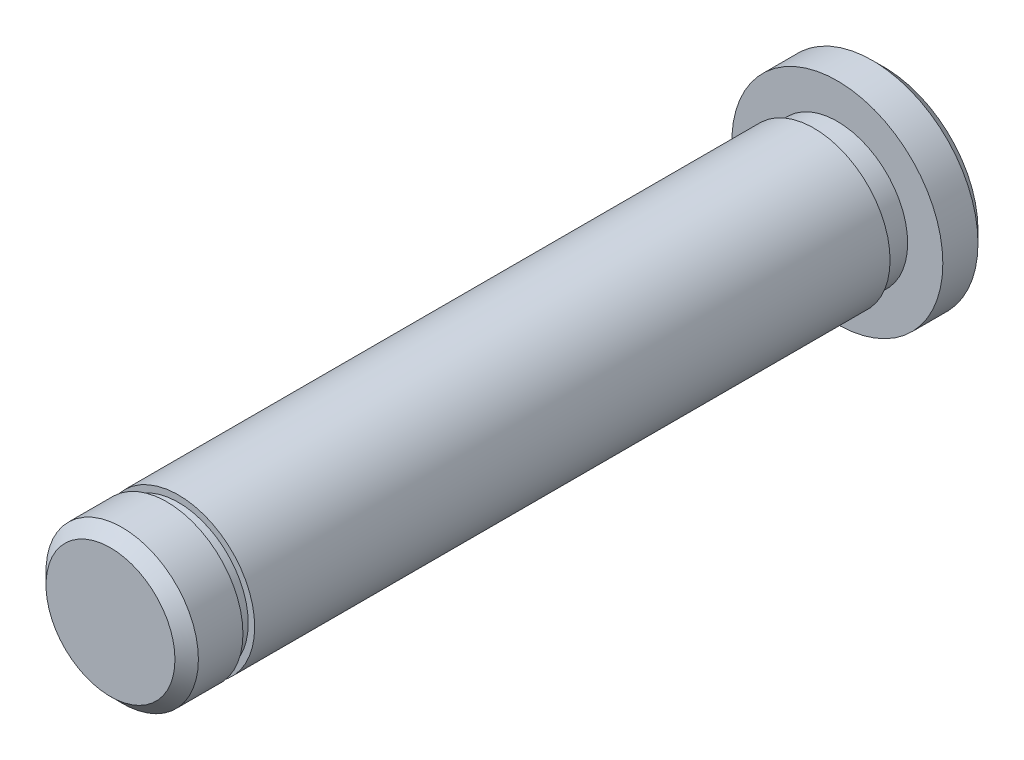
ISO-10303-21;
HEADER;
FILE_DESCRIPTION(('STEP AP214'),'2;1');
FILE_NAME('part.step','',(''),(''),'','','');
FILE_SCHEMA(('AUTOMOTIVE_DESIGN { 1 0 10303 214 1 1 1 1 }'));
ENDSEC;
DATA;
#1=APPLICATION_CONTEXT('core data for automotive mechanical design processes');
#2=APPLICATION_PROTOCOL_DEFINITION('international standard','automotive_design',2000,#1);
#3=PRODUCT_CONTEXT('',#1,'mechanical');
#4=PRODUCT('Part','Part','',(#3));
#5=PRODUCT_RELATED_PRODUCT_CATEGORY('part','',(#4));
#6=PRODUCT_DEFINITION_FORMATION('','',#4);
#7=PRODUCT_DEFINITION_CONTEXT('part definition',#1,'design');
#8=PRODUCT_DEFINITION('design','',#6,#7);
#9=PRODUCT_DEFINITION_SHAPE('','',#8);
#10=(LENGTH_UNIT() NAMED_UNIT(*) SI_UNIT(.MILLI.,.METRE.));
#11=(NAMED_UNIT(*) PLANE_ANGLE_UNIT() SI_UNIT($,.RADIAN.));
#12=(NAMED_UNIT(*) SI_UNIT($,.STERADIAN.) SOLID_ANGLE_UNIT());
#13=UNCERTAINTY_MEASURE_WITH_UNIT(LENGTH_MEASURE(1.E-05),#10,'distance_accuracy_value','');
#14=(GEOMETRIC_REPRESENTATION_CONTEXT(3) GLOBAL_UNCERTAINTY_ASSIGNED_CONTEXT((#13)) GLOBAL_UNIT_ASSIGNED_CONTEXT((#10,
#11,#12)) REPRESENTATION_CONTEXT('',''));
#15=CARTESIAN_POINT('',(0.,0.,0.));
#16=DIRECTION('',(0.,0.,1.));
#17=DIRECTION('',(1.,0.,0.));
#18=AXIS2_PLACEMENT_3D('',#15,#16,#17);
#19=CARTESIAN_POINT('',(0.,0.,66.));
#20=DIRECTION('',(0.,0.,-1.));
#21=DIRECTION('',(-1.,0.,0.));
#22=AXIS2_PLACEMENT_3D('',#19,#20,#21);
#23=CYLINDRICAL_SURFACE('',#22,6.5);
#24=CARTESIAN_POINT('',(0.,0.,6.));
#25=DIRECTION('',(0.,0.,1.));
#26=DIRECTION('',(1.,0.,0.));
#27=AXIS2_PLACEMENT_3D('',#24,#25,#26);
#28=CIRCLE('',#27,6.5);
#29=CARTESIAN_POINT('',(6.5,0.,6.));
#30=VERTEX_POINT('',#29);
#31=EDGE_CURVE('E67',#30,#30,#28,.T.);
#32=ORIENTED_EDGE('',*,*,#31,.T.);
#33=EDGE_LOOP('',(#32));
#34=FACE_BOUND('',#33,.T.);
#35=CARTESIAN_POINT('',(0.,0.,60.2));
#36=DIRECTION('',(0.,0.,1.));
#37=DIRECTION('',(1.,0.,0.));
#38=AXIS2_PLACEMENT_3D('',#35,#36,#37);
#39=CIRCLE('',#38,6.5);
#40=CARTESIAN_POINT('',(6.5,0.,60.2));
#41=VERTEX_POINT('',#40);
#42=EDGE_CURVE('E63',#41,#41,#39,.T.);
#43=ORIENTED_EDGE('',*,*,#42,.F.);
#44=EDGE_LOOP('',(#43));
#45=FACE_BOUND('',#44,.T.);
#46=ADVANCED_FACE('F37',(#34,#45),#23,.T.);
#47=CARTESIAN_POINT('',(0.,0.,4.));
#48=DIRECTION('',(0.,0.,-1.));
#49=DIRECTION('',(-1.,0.,0.));
#50=AXIS2_PLACEMENT_3D('',#47,#48,#49);
#51=CYLINDRICAL_SURFACE('',#50,9.);
#52=CARTESIAN_POINT('',(0.,0.,0.999999999999996));
#53=DIRECTION('',(0.,0.,1.));
#54=DIRECTION('',(1.,0.,0.));
#55=AXIS2_PLACEMENT_3D('',#52,#53,#54);
#56=CIRCLE('',#55,9.);
#57=CARTESIAN_POINT('',(9.,0.,0.999999999999996));
#58=VERTEX_POINT('',#57);
#59=EDGE_CURVE('E45',#58,#58,#56,.T.);
#60=ORIENTED_EDGE('',*,*,#59,.T.);
#61=EDGE_LOOP('',(#60));
#62=FACE_BOUND('',#61,.T.);
#63=CARTESIAN_POINT('',(0.,0.,4.));
#64=DIRECTION('',(0.,0.,1.));
#65=DIRECTION('',(1.,0.,0.));
#66=AXIS2_PLACEMENT_3D('',#63,#64,#65);
#67=CIRCLE('',#66,9.);
#68=CARTESIAN_POINT('',(9.,0.,4.));
#69=VERTEX_POINT('',#68);
#70=EDGE_CURVE('E58',#69,#69,#67,.T.);
#71=ORIENTED_EDGE('',*,*,#70,.F.);
#72=EDGE_LOOP('',(#71));
#73=FACE_BOUND('',#72,.T.);
#74=ADVANCED_FACE('F100',(#62,#73),#51,.T.);
#75=CARTESIAN_POINT('',(0.,0.,4.));
#76=DIRECTION('',(0.,0.,1.));
#77=DIRECTION('',(1.,0.,0.));
#78=AXIS2_PLACEMENT_3D('',#75,#76,#77);
#79=PLANE('',#78);
#80=ORIENTED_EDGE('',*,*,#70,.T.);
#81=EDGE_LOOP('',(#80));
#82=FACE_BOUND('',#81,.T.);
#83=CARTESIAN_POINT('',(0.,0.,4.));
#84=DIRECTION('',(0.,0.,1.));
#85=DIRECTION('',(1.,0.,0.));
#86=AXIS2_PLACEMENT_3D('',#83,#84,#85);
#87=CIRCLE('',#86,6.);
#88=CARTESIAN_POINT('',(6.,0.,4.));
#89=VERTEX_POINT('',#88);
#90=EDGE_CURVE('E62',#89,#89,#87,.T.);
#91=ORIENTED_EDGE('',*,*,#90,.F.);
#92=EDGE_LOOP('',(#91));
#93=FACE_BOUND('',#92,.T.);
#94=ADVANCED_FACE('F107',(#82,#93),#79,.T.);
#95=CARTESIAN_POINT('',(0.,0.,0.));
#96=DIRECTION('',(0.,0.,1.));
#97=DIRECTION('',(1.,0.,0.));
#98=AXIS2_PLACEMENT_3D('',#95,#96,#97);
#99=PLANE('',#98);
#100=CARTESIAN_POINT('',(0.,0.,0.));
#101=DIRECTION('',(0.,0.,1.));
#102=DIRECTION('',(1.,0.,0.));
#103=AXIS2_PLACEMENT_3D('',#100,#101,#102);
#104=CIRCLE('',#103,8.);
#105=CARTESIAN_POINT('',(8.,0.,0.));
#106=VERTEX_POINT('',#105);
#107=EDGE_CURVE('E11',#106,#106,#104,.F.);
#108=ORIENTED_EDGE('',*,*,#107,.T.);
#109=EDGE_LOOP('',(#108));
#110=FACE_BOUND('',#109,.T.);
#111=ADVANCED_FACE('F134',(#110),#99,.F.);
#112=CARTESIAN_POINT('',(0.,0.,6.));
#113=DIRECTION('',(0.,0.,1.));
#114=DIRECTION('',(1.,0.,0.));
#115=AXIS2_PLACEMENT_3D('',#112,#113,#114);
#116=PLANE('',#115);
#117=CARTESIAN_POINT('',(0.,0.,6.));
#118=DIRECTION('',(0.,0.,1.));
#119=DIRECTION('',(1.,0.,0.));
#120=AXIS2_PLACEMENT_3D('',#117,#118,#119);
#121=CIRCLE('',#120,6.);
#122=CARTESIAN_POINT('',(6.,0.,6.));
#123=VERTEX_POINT('',#122);
#124=EDGE_CURVE('E70',#123,#123,#121,.T.);
#125=ORIENTED_EDGE('',*,*,#124,.T.);
#126=EDGE_LOOP('',(#125));
#127=FACE_BOUND('',#126,.T.);
#128=ORIENTED_EDGE('',*,*,#31,.F.);
#129=EDGE_LOOP('',(#128));
#130=FACE_BOUND('',#129,.T.);
#131=ADVANCED_FACE('F129',(#127,#130),#116,.F.);
#132=CARTESIAN_POINT('',(0.,0.,6.));
#133=DIRECTION('',(0.,0.,-1.));
#134=DIRECTION('',(-1.,0.,0.));
#135=AXIS2_PLACEMENT_3D('',#132,#133,#134);
#136=CYLINDRICAL_SURFACE('',#135,6.);
#137=ORIENTED_EDGE('',*,*,#124,.F.);
#138=EDGE_LOOP('',(#137));
#139=FACE_BOUND('',#138,.T.);
#140=ORIENTED_EDGE('',*,*,#90,.T.);
#141=EDGE_LOOP('',(#140));
#142=FACE_BOUND('',#141,.T.);
#143=ADVANCED_FACE('F124',(#139,#142),#136,.T.);
#144=CARTESIAN_POINT('',(0.,0.,61.2));
#145=DIRECTION('',(0.,0.,1.));
#146=DIRECTION('',(1.,0.,0.));
#147=AXIS2_PLACEMENT_3D('',#144,#145,#146);
#148=PLANE('',#147);
#149=CARTESIAN_POINT('',(0.,0.,61.2));
#150=DIRECTION('',(0.,0.,1.));
#151=DIRECTION('',(1.,0.,0.));
#152=AXIS2_PLACEMENT_3D('',#149,#150,#151);
#153=CIRCLE('',#152,5.95);
#154=CARTESIAN_POINT('',(5.95,0.,61.2));
#155=VERTEX_POINT('',#154);
#156=EDGE_CURVE('E66',#155,#155,#153,.T.);
#157=ORIENTED_EDGE('',*,*,#156,.T.);
#158=EDGE_LOOP('',(#157));
#159=FACE_BOUND('',#158,.T.);
#160=CARTESIAN_POINT('',(0.,0.,61.2));
#161=DIRECTION('',(0.,0.,1.));
#162=DIRECTION('',(1.,0.,0.));
#163=AXIS2_PLACEMENT_3D('',#160,#161,#162);
#164=CIRCLE('',#163,6.5);
#165=CARTESIAN_POINT('',(6.5,0.,61.2));
#166=VERTEX_POINT('',#165);
#167=EDGE_CURVE('E59',#166,#166,#164,.T.);
#168=ORIENTED_EDGE('',*,*,#167,.F.);
#169=EDGE_LOOP('',(#168));
#170=FACE_BOUND('',#169,.T.);
#171=ADVANCED_FACE('F83',(#159,#170),#148,.F.);
#172=CARTESIAN_POINT('',(0.,0.,60.2));
#173=DIRECTION('',(0.,0.,1.));
#174=DIRECTION('',(1.,0.,0.));
#175=AXIS2_PLACEMENT_3D('',#172,#173,#174);
#176=PLANE('',#175);
#177=CARTESIAN_POINT('',(0.,0.,60.2));
#178=DIRECTION('',(0.,0.,1.));
#179=DIRECTION('',(1.,0.,0.));
#180=AXIS2_PLACEMENT_3D('',#177,#178,#179);
#181=CIRCLE('',#180,5.95);
#182=CARTESIAN_POINT('',(5.95,0.,60.2));
#183=VERTEX_POINT('',#182);
#184=EDGE_CURVE('E77',#183,#183,#181,.T.);
#185=ORIENTED_EDGE('',*,*,#184,.F.);
#186=EDGE_LOOP('',(#185));
#187=FACE_BOUND('',#186,.T.);
#188=ORIENTED_EDGE('',*,*,#42,.T.);
#189=EDGE_LOOP('',(#188));
#190=FACE_BOUND('',#189,.T.);
#191=ADVANCED_FACE('F90',(#187,#190),#176,.T.);
#192=CARTESIAN_POINT('',(0.,0.,61.2));
#193=DIRECTION('',(0.,0.,-1.));
#194=DIRECTION('',(-1.,0.,0.));
#195=AXIS2_PLACEMENT_3D('',#192,#193,#194);
#196=CYLINDRICAL_SURFACE('',#195,5.95);
#197=ORIENTED_EDGE('',*,*,#156,.F.);
#198=EDGE_LOOP('',(#197));
#199=FACE_BOUND('',#198,.T.);
#200=ORIENTED_EDGE('',*,*,#184,.T.);
#201=EDGE_LOOP('',(#200));
#202=FACE_BOUND('',#201,.T.);
#203=ADVANCED_FACE('F86',(#199,#202),#196,.T.);
#204=CARTESIAN_POINT('',(0.,0.,66.));
#205=DIRECTION('',(0.,0.,1.));
#206=DIRECTION('',(1.,0.,0.));
#207=AXIS2_PLACEMENT_3D('',#204,#205,#206);
#208=PLANE('',#207);
#209=CARTESIAN_POINT('',(0.,0.,66.));
#210=DIRECTION('',(0.,0.,1.));
#211=DIRECTION('',(1.,0.,0.));
#212=AXIS2_PLACEMENT_3D('',#209,#210,#211);
#213=CIRCLE('',#212,5.49999999999999);
#214=CARTESIAN_POINT('',(5.49999999999999,0.,66.));
#215=VERTEX_POINT('',#214);
#216=EDGE_CURVE('E53',#215,#215,#213,.T.);
#217=ORIENTED_EDGE('',*,*,#216,.T.);
#218=EDGE_LOOP('',(#217));
#219=FACE_BOUND('',#218,.T.);
#220=ADVANCED_FACE('F89',(#219),#208,.T.);
#221=CARTESIAN_POINT('',(0.,0.,65.));
#222=DIRECTION('',(0.,0.,1.));
#223=DIRECTION('',(1.,0.,0.));
#224=AXIS2_PLACEMENT_3D('',#221,#222,#223);
#225=CIRCLE('',#224,6.5);
#226=CARTESIAN_POINT('',(6.5,0.,65.));
#227=VERTEX_POINT('',#226);
#228=EDGE_CURVE('E49',#227,#227,#225,.F.);
#229=ORIENTED_EDGE('',*,*,#228,.T.);
#230=EDGE_LOOP('',(#229));
#231=FACE_BOUND('',#230,.T.);
#232=ORIENTED_EDGE('',*,*,#167,.T.);
#233=EDGE_LOOP('',(#232));
#234=FACE_BOUND('',#233,.T.);
#235=ADVANCED_FACE('F103',(#231,#234),#23,.T.);
#236=CARTESIAN_POINT('',(0.,0.,66.));
#237=DIRECTION('',(0.,0.,-1.));
#238=DIRECTION('',(-1.,0.,0.));
#239=AXIS2_PLACEMENT_3D('',#236,#237,#238);
#240=CONICAL_SURFACE('',#239,5.49999999999999,0.785398163397446);
#241=ORIENTED_EDGE('',*,*,#228,.F.);
#242=EDGE_LOOP('',(#241));
#243=FACE_BOUND('',#242,.T.);
#244=ORIENTED_EDGE('',*,*,#216,.F.);
#245=EDGE_LOOP('',(#244));
#246=FACE_BOUND('',#245,.T.);
#247=ADVANCED_FACE('F112',(#243,#246),#240,.T.);
#248=CARTESIAN_POINT('',(0.,0.,0.999999999999996));
#249=DIRECTION('',(0.,0.,1.));
#250=DIRECTION('',(1.,0.,0.));
#251=AXIS2_PLACEMENT_3D('',#248,#249,#250);
#252=CONICAL_SURFACE('',#251,9.,0.78539816339745);
#253=ORIENTED_EDGE('',*,*,#107,.F.);
#254=EDGE_LOOP('',(#253));
#255=FACE_BOUND('',#254,.T.);
#256=ORIENTED_EDGE('',*,*,#59,.F.);
#257=EDGE_LOOP('',(#256));
#258=FACE_BOUND('',#257,.T.);
#259=ADVANCED_FACE('F40',(#255,#258),#252,.T.);
#260=CLOSED_SHELL('',(#46,#74,#94,#111,#131,#143,#171,#191,#203,#220,#235,#247,#259));
#261=MANIFOLD_SOLID_BREP('B2',#260);
#262=ADVANCED_BREP_SHAPE_REPRESENTATION('',(#18,#261),#14);
#263=SHAPE_DEFINITION_REPRESENTATION(#9,#262);
ENDSEC;
END-ISO-10303-21;
